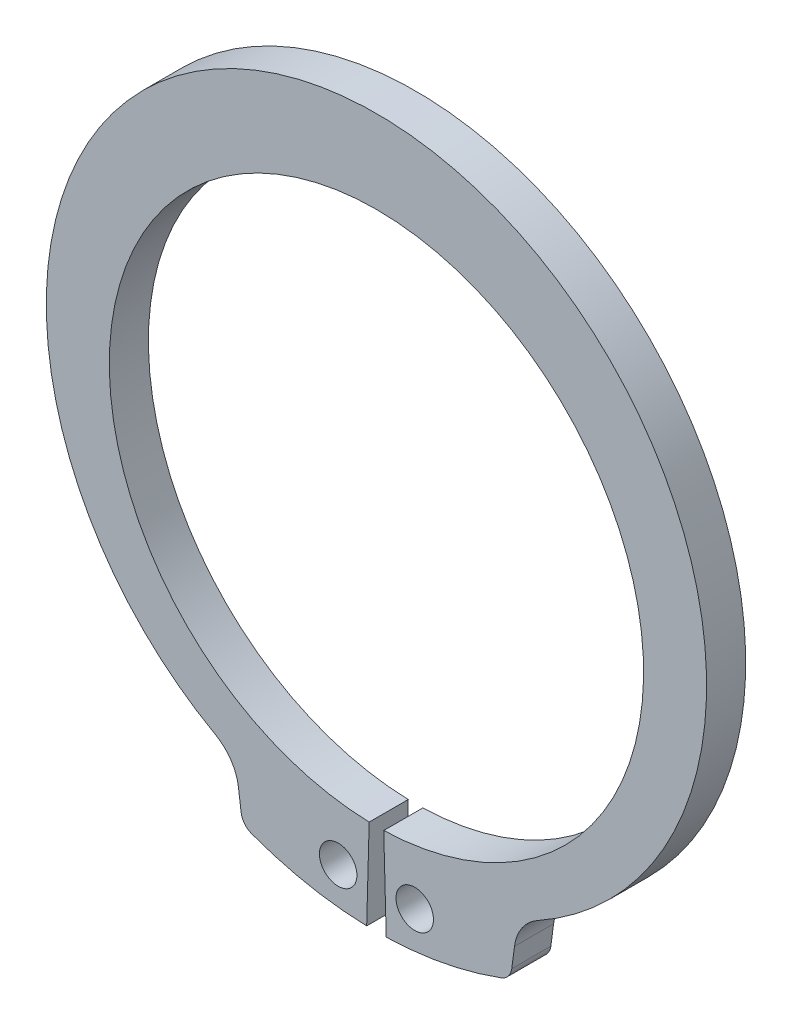
ISO-10303-21;
HEADER;
FILE_DESCRIPTION(('STEP AP214'),'2;1');
FILE_NAME('part.step','',(''),(''),'','','');
FILE_SCHEMA(('AUTOMOTIVE_DESIGN { 1 0 10303 214 1 1 1 1 }'));
ENDSEC;
DATA;
#1=APPLICATION_CONTEXT('core data for automotive mechanical design processes');
#2=APPLICATION_PROTOCOL_DEFINITION('international standard','automotive_design',2000,#1);
#3=PRODUCT_CONTEXT('',#1,'mechanical');
#4=PRODUCT('Part','Part','',(#3));
#5=PRODUCT_RELATED_PRODUCT_CATEGORY('part','',(#4));
#6=PRODUCT_DEFINITION_FORMATION('','',#4);
#7=PRODUCT_DEFINITION_CONTEXT('part definition',#1,'design');
#8=PRODUCT_DEFINITION('design','',#6,#7);
#9=PRODUCT_DEFINITION_SHAPE('','',#8);
#10=(LENGTH_UNIT() NAMED_UNIT(*) SI_UNIT(.MILLI.,.METRE.));
#11=(NAMED_UNIT(*) PLANE_ANGLE_UNIT() SI_UNIT($,.RADIAN.));
#12=(NAMED_UNIT(*) SI_UNIT($,.STERADIAN.) SOLID_ANGLE_UNIT());
#13=UNCERTAINTY_MEASURE_WITH_UNIT(LENGTH_MEASURE(1.E-05),#10,'distance_accuracy_value','');
#14=(GEOMETRIC_REPRESENTATION_CONTEXT(3) GLOBAL_UNCERTAINTY_ASSIGNED_CONTEXT((#13)) GLOBAL_UNIT_ASSIGNED_CONTEXT((#10,
#11,#12)) REPRESENTATION_CONTEXT('',''));
#15=CARTESIAN_POINT('',(0.,0.,0.));
#16=DIRECTION('',(0.,0.,1.));
#17=DIRECTION('',(1.,0.,0.));
#18=AXIS2_PLACEMENT_3D('',#15,#16,#17);
#19=CARTESIAN_POINT('',(0.,0.,-2.4));
#20=DIRECTION('',(0.,0.,1.));
#21=DIRECTION('',(1.,0.,0.));
#22=AXIS2_PLACEMENT_3D('',#19,#20,#21);
#23=CYLINDRICAL_SURFACE('',#22,16.4);
#24=CARTESIAN_POINT('',(0.,0.,0.));
#25=DIRECTION('',(0.,0.,-1.));
#26=DIRECTION('',(1.,0.,0.));
#27=AXIS2_PLACEMENT_3D('',#24,#25,#26);
#28=CIRCLE('',#27,16.4);
#29=CARTESIAN_POINT('',(-0.447272727272727,-16.3938996918805,0.));
#30=VERTEX_POINT('',#29);
#31=CARTESIAN_POINT('',(0.447272727272727,-16.3938996918805,0.));
#32=VERTEX_POINT('',#31);
#33=EDGE_CURVE('E153',#30,#32,#28,.T.);
#34=ORIENTED_EDGE('',*,*,#33,.F.);
#35=DIRECTION('',(0.,0.,1.));
#36=VECTOR('',#35,1.);
#37=CARTESIAN_POINT('',(-0.447272727272727,-16.3938996918805,-2.4));
#38=LINE('',#37,#36);
#39=CARTESIAN_POINT('',(-0.447272727272727,-16.3938996918805,-2.4));
#40=VERTEX_POINT('',#39);
#41=EDGE_CURVE('E11',#40,#30,#38,.T.);
#42=ORIENTED_EDGE('',*,*,#41,.F.);
#43=CARTESIAN_POINT('',(0.,0.,-2.4));
#44=DIRECTION('',(0.,0.,-1.));
#45=DIRECTION('',(1.,0.,0.));
#46=AXIS2_PLACEMENT_3D('',#43,#44,#45);
#47=CIRCLE('',#46,16.4);
#48=CARTESIAN_POINT('',(0.447272727272727,-16.3938996918805,-2.4));
#49=VERTEX_POINT('',#48);
#50=EDGE_CURVE('E186',#40,#49,#47,.T.);
#51=ORIENTED_EDGE('',*,*,#50,.T.);
#52=DIRECTION('',(0.,0.,1.));
#53=VECTOR('',#52,1.);
#54=CARTESIAN_POINT('',(0.447272727272727,-16.3938996918805,-2.4));
#55=LINE('',#54,#53);
#56=EDGE_CURVE('E35',#49,#32,#55,.T.);
#57=ORIENTED_EDGE('',*,*,#56,.T.);
#58=EDGE_LOOP('',(#34,#42,#51,#57));
#59=FACE_BOUND('',#58,.T.);
#60=ADVANCED_FACE('F32',(#59),#23,.F.);
#61=CARTESIAN_POINT('',(-0.447272727272727,-16.3938996918805,-2.4));
#62=DIRECTION('',(0.999628029992711,-0.0272727272727273,0.));
#63=DIRECTION('',(0.0272727272727273,0.999628029992711,0.));
#64=AXIS2_PLACEMENT_3D('',#61,#62,#63);
#65=PLANE('',#64);
#66=DIRECTION('',(0.0272727272727273,0.999628029992711,0.));
#67=VECTOR('',#66,1.);
#68=CARTESIAN_POINT('',(-0.447272727272727,-16.3938996918805,0.));
#69=LINE('',#68,#67);
#70=CARTESIAN_POINT('',(-0.6,-21.9918166598396,0.));
#71=VERTEX_POINT('',#70);
#72=EDGE_CURVE('E184',#71,#30,#69,.T.);
#73=ORIENTED_EDGE('',*,*,#72,.F.);
#74=DIRECTION('',(0.,0.,1.));
#75=VECTOR('',#74,1.);
#76=CARTESIAN_POINT('',(-0.6,-21.9918166598396,-2.4));
#77=LINE('',#76,#75);
#78=CARTESIAN_POINT('',(-0.6,-21.9918166598396,-2.4));
#79=VERTEX_POINT('',#78);
#80=EDGE_CURVE('E41',#79,#71,#77,.T.);
#81=ORIENTED_EDGE('',*,*,#80,.F.);
#82=DIRECTION('',(0.0272727272727273,0.999628029992711,0.));
#83=VECTOR('',#82,1.);
#84=CARTESIAN_POINT('',(-0.447272727272727,-16.3938996918805,-2.4));
#85=LINE('',#84,#83);
#86=EDGE_CURVE('E143',#79,#40,#85,.T.);
#87=ORIENTED_EDGE('',*,*,#86,.T.);
#88=ORIENTED_EDGE('',*,*,#41,.T.);
#89=EDGE_LOOP('',(#73,#81,#87,#88));
#90=FACE_BOUND('',#89,.T.);
#91=ADVANCED_FACE('F206',(#90),#65,.T.);
#92=CARTESIAN_POINT('',(0.,0.,-2.4));
#93=DIRECTION('',(0.,0.,1.));
#94=DIRECTION('',(1.,0.,0.));
#95=AXIS2_PLACEMENT_3D('',#92,#93,#94);
#96=CYLINDRICAL_SURFACE('',#95,22.);
#97=CARTESIAN_POINT('',(0.,0.,0.));
#98=DIRECTION('',(0.,0.,1.));
#99=DIRECTION('',(1.,0.,0.));
#100=AXIS2_PLACEMENT_3D('',#97,#98,#99);
#101=CIRCLE('',#100,22.);
#102=CARTESIAN_POINT('',(-7.66322406061849,-20.6221967063831,0.));
#103=VERTEX_POINT('',#102);
#104=EDGE_CURVE('E130',#103,#71,#101,.T.);
#105=ORIENTED_EDGE('',*,*,#104,.F.);
#106=DIRECTION('',(0.,0.,1.));
#107=VECTOR('',#106,1.);
#108=CARTESIAN_POINT('',(-7.66322406061849,-20.6221967063831,-2.4));
#109=LINE('',#108,#107);
#110=CARTESIAN_POINT('',(-7.66322406061849,-20.6221967063831,-2.4));
#111=VERTEX_POINT('',#110);
#112=EDGE_CURVE('E125',#111,#103,#109,.T.);
#113=ORIENTED_EDGE('',*,*,#112,.F.);
#114=CARTESIAN_POINT('',(0.,0.,-2.4));
#115=DIRECTION('',(0.,0.,1.));
#116=DIRECTION('',(1.,0.,0.));
#117=AXIS2_PLACEMENT_3D('',#114,#115,#116);
#118=CIRCLE('',#117,22.);
#119=EDGE_CURVE('E128',#111,#79,#118,.T.);
#120=ORIENTED_EDGE('',*,*,#119,.T.);
#121=ORIENTED_EDGE('',*,*,#80,.T.);
#122=EDGE_LOOP('',(#105,#113,#120,#121));
#123=FACE_BOUND('',#122,.T.);
#124=ADVANCED_FACE('F127',(#123),#96,.T.);
#125=CARTESIAN_POINT('',(-7.31489569422674,-19.6848241288202,-2.4));
#126=DIRECTION('',(0.,0.,1.));
#127=DIRECTION('',(1.,0.,0.));
#128=AXIS2_PLACEMENT_3D('',#125,#126,#127);
#129=CYLINDRICAL_SURFACE('',#128,1.);
#130=CARTESIAN_POINT('',(-7.31489569422674,-19.6848241288202,0.));
#131=DIRECTION('',(0.,0.,1.));
#132=DIRECTION('',(1.,0.,0.));
#133=AXIS2_PLACEMENT_3D('',#130,#131,#132);
#134=CIRCLE('',#133,1.);
#135=CARTESIAN_POINT('',(-8.30634055560055,-19.8153503210403,0.));
#136=VERTEX_POINT('',#135);
#137=EDGE_CURVE('E181',#136,#103,#134,.T.);
#138=ORIENTED_EDGE('',*,*,#137,.F.);
#139=DIRECTION('',(0.,0.,1.));
#140=VECTOR('',#139,1.);
#141=CARTESIAN_POINT('',(-8.30634055560055,-19.8153503210403,-2.4));
#142=LINE('',#141,#140);
#143=CARTESIAN_POINT('',(-8.30634055560055,-19.8153503210403,-2.4));
#144=VERTEX_POINT('',#143);
#145=EDGE_CURVE('E135',#144,#136,#142,.T.);
#146=ORIENTED_EDGE('',*,*,#145,.F.);
#147=CARTESIAN_POINT('',(-7.31489569422674,-19.6848241288202,-2.4));
#148=DIRECTION('',(0.,0.,1.));
#149=DIRECTION('',(1.,0.,0.));
#150=AXIS2_PLACEMENT_3D('',#147,#148,#149);
#151=CIRCLE('',#150,1.);
#152=EDGE_CURVE('E141',#144,#111,#151,.T.);
#153=ORIENTED_EDGE('',*,*,#152,.T.);
#154=ORIENTED_EDGE('',*,*,#112,.T.);
#155=EDGE_LOOP('',(#138,#146,#153,#154));
#156=FACE_BOUND('',#155,.T.);
#157=ADVANCED_FACE('F145',(#156),#129,.T.);
#158=CARTESIAN_POINT('',(-8.47406820275926,-18.5413323553168,-2.4));
#159=DIRECTION('',(-0.991444861373811,-0.130526192220046,0.));
#160=DIRECTION('',(0.130526192220046,-0.991444861373811,0.));
#161=AXIS2_PLACEMENT_3D('',#158,#159,#160);
#162=PLANE('',#161);
#163=DIRECTION('',(0.130526192220046,-0.991444861373811,0.));
#164=VECTOR('',#163,1.);
#165=CARTESIAN_POINT('',(-8.47406820275926,-18.5413323553168,0.));
#166=LINE('',#165,#164);
#167=CARTESIAN_POINT('',(-8.47406820275926,-18.5413323553168,0.));
#168=VERTEX_POINT('',#167);
#169=EDGE_CURVE('E178',#168,#136,#166,.T.);
#170=ORIENTED_EDGE('',*,*,#169,.F.);
#171=DIRECTION('',(0.,0.,1.));
#172=VECTOR('',#171,1.);
#173=CARTESIAN_POINT('',(-8.47406820275926,-18.5413323553168,-2.4));
#174=LINE('',#173,#172);
#175=CARTESIAN_POINT('',(-8.47406820275926,-18.5413323553168,-2.4));
#176=VERTEX_POINT('',#175);
#177=EDGE_CURVE('E190',#176,#168,#174,.T.);
#178=ORIENTED_EDGE('',*,*,#177,.F.);
#179=DIRECTION('',(0.130526192220046,-0.991444861373811,0.));
#180=VECTOR('',#179,1.);
#181=CARTESIAN_POINT('',(-8.47406820275926,-18.5413323553168,-2.4));
#182=LINE('',#181,#180);
#183=EDGE_CURVE('E146',#176,#144,#182,.T.);
#184=ORIENTED_EDGE('',*,*,#183,.T.);
#185=ORIENTED_EDGE('',*,*,#145,.T.);
#186=EDGE_LOOP('',(#170,#178,#184,#185));
#187=FACE_BOUND('',#186,.T.);
#188=ADVANCED_FACE('F219',(#187),#162,.T.);
#189=CARTESIAN_POINT('',(-11.2489360281673,-18.9066506350067,-2.4));
#190=DIRECTION('',(0.,0.,1.));
#191=DIRECTION('',(1.,0.,0.));
#192=AXIS2_PLACEMENT_3D('',#189,#190,#191);
#193=CYLINDRICAL_SURFACE('',#192,2.79881205048863);
#194=CARTESIAN_POINT('',(-11.2489360281673,-18.9066506350067,0.));
#195=DIRECTION('',(0.,0.,-1.));
#196=DIRECTION('',(1.,0.,0.));
#197=AXIS2_PLACEMENT_3D('',#194,#195,#196);
#198=CIRCLE('',#197,2.79881205048863);
#199=CARTESIAN_POINT('',(-9.8840639739305,-16.4631954646539,0.));
#200=VERTEX_POINT('',#199);
#201=EDGE_CURVE('E175',#200,#168,#198,.T.);
#202=ORIENTED_EDGE('',*,*,#201,.F.);
#203=DIRECTION('',(0.,0.,1.));
#204=VECTOR('',#203,1.);
#205=CARTESIAN_POINT('',(-9.8840639739305,-16.4631954646539,-2.4));
#206=LINE('',#205,#204);
#207=CARTESIAN_POINT('',(-9.8840639739305,-16.4631954646539,-2.4));
#208=VERTEX_POINT('',#207);
#209=EDGE_CURVE('E192',#208,#200,#206,.T.);
#210=ORIENTED_EDGE('',*,*,#209,.F.);
#211=CARTESIAN_POINT('',(-11.2489360281673,-18.9066506350067,-2.4));
#212=DIRECTION('',(0.,0.,-1.));
#213=DIRECTION('',(1.,0.,0.));
#214=AXIS2_PLACEMENT_3D('',#211,#212,#213);
#215=CIRCLE('',#214,2.79881205048863);
#216=EDGE_CURVE('E148',#208,#176,#215,.T.);
#217=ORIENTED_EDGE('',*,*,#216,.T.);
#218=ORIENTED_EDGE('',*,*,#177,.T.);
#219=EDGE_LOOP('',(#202,#210,#217,#218));
#220=FACE_BOUND('',#219,.T.);
#221=ADVANCED_FACE('F222',(#220),#193,.F.);
#222=CARTESIAN_POINT('',(0.,1.23169919322148,-2.4));
#223=DIRECTION('',(0.,0.,1.));
#224=DIRECTION('',(1.,0.,0.));
#225=AXIS2_PLACEMENT_3D('',#222,#223,#224);
#226=CYLINDRICAL_SURFACE('',#225,20.2683008067785);
#227=CARTESIAN_POINT('',(0.,1.23169919322148,0.));
#228=DIRECTION('',(0.,0.,1.));
#229=DIRECTION('',(1.,0.,0.));
#230=AXIS2_PLACEMENT_3D('',#227,#228,#229);
#231=CIRCLE('',#230,20.2683008067785);
#232=CARTESIAN_POINT('',(9.8840639739305,-16.4631954646539,0.));
#233=VERTEX_POINT('',#232);
#234=EDGE_CURVE('E172',#233,#200,#231,.T.);
#235=ORIENTED_EDGE('',*,*,#234,.F.);
#236=DIRECTION('',(0.,0.,1.));
#237=VECTOR('',#236,1.);
#238=CARTESIAN_POINT('',(9.8840639739305,-16.4631954646539,-2.4));
#239=LINE('',#238,#237);
#240=CARTESIAN_POINT('',(9.8840639739305,-16.4631954646539,-2.4));
#241=VERTEX_POINT('',#240);
#242=EDGE_CURVE('E194',#241,#233,#239,.T.);
#243=ORIENTED_EDGE('',*,*,#242,.F.);
#244=CARTESIAN_POINT('',(0.,1.23169919322148,-2.4));
#245=DIRECTION('',(0.,0.,1.));
#246=DIRECTION('',(1.,0.,0.));
#247=AXIS2_PLACEMENT_3D('',#244,#245,#246);
#248=CIRCLE('',#247,20.2683008067785);
#249=EDGE_CURVE('E296',#241,#208,#248,.T.);
#250=ORIENTED_EDGE('',*,*,#249,.T.);
#251=ORIENTED_EDGE('',*,*,#209,.T.);
#252=EDGE_LOOP('',(#235,#243,#250,#251));
#253=FACE_BOUND('',#252,.T.);
#254=ADVANCED_FACE('F226',(#253),#226,.T.);
#255=CARTESIAN_POINT('',(11.2489360281673,-18.9066506350067,-2.4));
#256=DIRECTION('',(0.,0.,1.));
#257=DIRECTION('',(1.,0.,0.));
#258=AXIS2_PLACEMENT_3D('',#255,#256,#257);
#259=CYLINDRICAL_SURFACE('',#258,2.79881205048863);
#260=CARTESIAN_POINT('',(11.2489360281673,-18.9066506350067,0.));
#261=DIRECTION('',(0.,0.,-1.));
#262=DIRECTION('',(1.,0.,0.));
#263=AXIS2_PLACEMENT_3D('',#260,#261,#262);
#264=CIRCLE('',#263,2.79881205048863);
#265=CARTESIAN_POINT('',(8.47406820275926,-18.5413323553168,0.));
#266=VERTEX_POINT('',#265);
#267=EDGE_CURVE('E169',#266,#233,#264,.T.);
#268=ORIENTED_EDGE('',*,*,#267,.F.);
#269=DIRECTION('',(0.,0.,1.));
#270=VECTOR('',#269,1.);
#271=CARTESIAN_POINT('',(8.47406820275926,-18.5413323553168,-2.4));
#272=LINE('',#271,#270);
#273=CARTESIAN_POINT('',(8.47406820275926,-18.5413323553168,-2.4));
#274=VERTEX_POINT('',#273);
#275=EDGE_CURVE('E196',#274,#266,#272,.T.);
#276=ORIENTED_EDGE('',*,*,#275,.F.);
#277=CARTESIAN_POINT('',(11.2489360281673,-18.9066506350067,-2.4));
#278=DIRECTION('',(0.,0.,-1.));
#279=DIRECTION('',(1.,0.,0.));
#280=AXIS2_PLACEMENT_3D('',#277,#278,#279);
#281=CIRCLE('',#280,2.79881205048863);
#282=EDGE_CURVE('E293',#274,#241,#281,.T.);
#283=ORIENTED_EDGE('',*,*,#282,.T.);
#284=ORIENTED_EDGE('',*,*,#242,.T.);
#285=EDGE_LOOP('',(#268,#276,#283,#284));
#286=FACE_BOUND('',#285,.T.);
#287=ADVANCED_FACE('F230',(#286),#259,.F.);
#288=CARTESIAN_POINT('',(8.47406820275926,-18.5413323553168,-2.4));
#289=DIRECTION('',(0.991444861373811,-0.130526192220046,0.));
#290=DIRECTION('',(0.130526192220046,0.991444861373811,0.));
#291=AXIS2_PLACEMENT_3D('',#288,#289,#290);
#292=PLANE('',#291);
#293=DIRECTION('',(0.130526192220046,0.991444861373811,0.));
#294=VECTOR('',#293,1.);
#295=CARTESIAN_POINT('',(8.47406820275926,-18.5413323553168,0.));
#296=LINE('',#295,#294);
#297=CARTESIAN_POINT('',(8.30634055560056,-19.8153503210403,0.));
#298=VERTEX_POINT('',#297);
#299=EDGE_CURVE('E166',#298,#266,#296,.T.);
#300=ORIENTED_EDGE('',*,*,#299,.F.);
#301=DIRECTION('',(0.,0.,1.));
#302=VECTOR('',#301,1.);
#303=CARTESIAN_POINT('',(8.30634055560056,-19.8153503210403,-2.4));
#304=LINE('',#303,#302);
#305=CARTESIAN_POINT('',(8.30634055560056,-19.8153503210403,-2.4));
#306=VERTEX_POINT('',#305);
#307=EDGE_CURVE('E198',#306,#298,#304,.T.);
#308=ORIENTED_EDGE('',*,*,#307,.F.);
#309=DIRECTION('',(0.130526192220046,0.991444861373811,0.));
#310=VECTOR('',#309,1.);
#311=CARTESIAN_POINT('',(8.47406820275926,-18.5413323553168,-2.4));
#312=LINE('',#311,#310);
#313=EDGE_CURVE('E290',#306,#274,#312,.T.);
#314=ORIENTED_EDGE('',*,*,#313,.T.);
#315=ORIENTED_EDGE('',*,*,#275,.T.);
#316=EDGE_LOOP('',(#300,#308,#314,#315));
#317=FACE_BOUND('',#316,.T.);
#318=ADVANCED_FACE('F234',(#317),#292,.T.);
#319=CARTESIAN_POINT('',(7.31489569422674,-19.6848241288202,-2.4));
#320=DIRECTION('',(0.,0.,1.));
#321=DIRECTION('',(1.,0.,0.));
#322=AXIS2_PLACEMENT_3D('',#319,#320,#321);
#323=CYLINDRICAL_SURFACE('',#322,1.);
#324=CARTESIAN_POINT('',(7.31489569422674,-19.6848241288202,0.));
#325=DIRECTION('',(0.,0.,1.));
#326=DIRECTION('',(-1.,0.,0.));
#327=AXIS2_PLACEMENT_3D('',#324,#325,#326);
#328=CIRCLE('',#327,1.);
#329=CARTESIAN_POINT('',(7.66322406061849,-20.6221967063831,0.));
#330=VERTEX_POINT('',#329);
#331=EDGE_CURVE('E163',#330,#298,#328,.T.);
#332=ORIENTED_EDGE('',*,*,#331,.F.);
#333=DIRECTION('',(0.,0.,1.));
#334=VECTOR('',#333,1.);
#335=CARTESIAN_POINT('',(7.66322406061849,-20.6221967063831,-2.4));
#336=LINE('',#335,#334);
#337=CARTESIAN_POINT('',(7.66322406061849,-20.6221967063831,-2.4));
#338=VERTEX_POINT('',#337);
#339=EDGE_CURVE('E200',#338,#330,#336,.T.);
#340=ORIENTED_EDGE('',*,*,#339,.F.);
#341=CARTESIAN_POINT('',(7.31489569422674,-19.6848241288202,-2.4));
#342=DIRECTION('',(0.,0.,1.));
#343=DIRECTION('',(-1.,0.,0.));
#344=AXIS2_PLACEMENT_3D('',#341,#342,#343);
#345=CIRCLE('',#344,1.);
#346=EDGE_CURVE('E287',#338,#306,#345,.T.);
#347=ORIENTED_EDGE('',*,*,#346,.T.);
#348=ORIENTED_EDGE('',*,*,#307,.T.);
#349=EDGE_LOOP('',(#332,#340,#347,#348));
#350=FACE_BOUND('',#349,.T.);
#351=ADVANCED_FACE('F238',(#350),#323,.T.);
#352=CARTESIAN_POINT('',(0.,0.,-2.4));
#353=DIRECTION('',(0.,0.,1.));
#354=DIRECTION('',(1.,0.,0.));
#355=AXIS2_PLACEMENT_3D('',#352,#353,#354);
#356=CYLINDRICAL_SURFACE('',#355,22.);
#357=CARTESIAN_POINT('',(0.,0.,0.));
#358=DIRECTION('',(0.,0.,1.));
#359=DIRECTION('',(1.,0.,0.));
#360=AXIS2_PLACEMENT_3D('',#357,#358,#359);
#361=CIRCLE('',#360,22.);
#362=CARTESIAN_POINT('',(0.599999999999996,-21.9918166598396,0.));
#363=VERTEX_POINT('',#362);
#364=EDGE_CURVE('E160',#363,#330,#361,.T.);
#365=ORIENTED_EDGE('',*,*,#364,.F.);
#366=DIRECTION('',(0.,0.,1.));
#367=VECTOR('',#366,1.);
#368=CARTESIAN_POINT('',(0.599999999999996,-21.9918166598396,-2.4));
#369=LINE('',#368,#367);
#370=CARTESIAN_POINT('',(0.599999999999996,-21.9918166598396,-2.4));
#371=VERTEX_POINT('',#370);
#372=EDGE_CURVE('E201',#371,#363,#369,.T.);
#373=ORIENTED_EDGE('',*,*,#372,.F.);
#374=CARTESIAN_POINT('',(0.,0.,-2.4));
#375=DIRECTION('',(0.,0.,1.));
#376=DIRECTION('',(1.,0.,0.));
#377=AXIS2_PLACEMENT_3D('',#374,#375,#376);
#378=CIRCLE('',#377,22.);
#379=EDGE_CURVE('E284',#371,#338,#378,.T.);
#380=ORIENTED_EDGE('',*,*,#379,.T.);
#381=ORIENTED_EDGE('',*,*,#339,.T.);
#382=EDGE_LOOP('',(#365,#373,#380,#381));
#383=FACE_BOUND('',#382,.T.);
#384=ADVANCED_FACE('F242',(#383),#356,.T.);
#385=CARTESIAN_POINT('',(0.447272727272727,-16.3938996918805,-2.4));
#386=DIRECTION('',(-0.999628029992711,-0.0272727272727273,0.));
#387=DIRECTION('',(0.0272727272727273,-0.999628029992711,0.));
#388=AXIS2_PLACEMENT_3D('',#385,#386,#387);
#389=PLANE('',#388);
#390=DIRECTION('',(0.0272727272727273,-0.999628029992711,0.));
#391=VECTOR('',#390,1.);
#392=CARTESIAN_POINT('',(0.447272727272727,-16.3938996918805,0.));
#393=LINE('',#392,#391);
#394=EDGE_CURVE('E156',#32,#363,#393,.T.);
#395=ORIENTED_EDGE('',*,*,#394,.F.);
#396=ORIENTED_EDGE('',*,*,#56,.F.);
#397=DIRECTION('',(0.0272727272727273,-0.999628029992711,0.));
#398=VECTOR('',#397,1.);
#399=CARTESIAN_POINT('',(0.447272727272727,-16.3938996918805,-2.4));
#400=LINE('',#399,#398);
#401=EDGE_CURVE('E282',#49,#371,#400,.T.);
#402=ORIENTED_EDGE('',*,*,#401,.T.);
#403=ORIENTED_EDGE('',*,*,#372,.T.);
#404=EDGE_LOOP('',(#395,#396,#402,#403));
#405=FACE_BOUND('',#404,.T.);
#406=ADVANCED_FACE('F203',(#405),#389,.T.);
#407=CARTESIAN_POINT('',(0.,0.,-2.4));
#408=DIRECTION('',(0.,0.,1.));
#409=DIRECTION('',(1.,0.,0.));
#410=AXIS2_PLACEMENT_3D('',#407,#408,#409);
#411=PLANE('',#410);
#412=CARTESIAN_POINT('',(-2.35,-19.6096914815099,-2.4));
#413=DIRECTION('',(0.,0.,1.));
#414=DIRECTION('',(1.,0.,0.));
#415=AXIS2_PLACEMENT_3D('',#412,#413,#414);
#416=CIRCLE('',#415,1.15);
#417=CARTESIAN_POINT('',(-1.2,-19.6096914815099,-2.4));
#418=VERTEX_POINT('',#417);
#419=EDGE_CURVE('E269',#418,#418,#416,.T.);
#420=ORIENTED_EDGE('',*,*,#419,.T.);
#421=EDGE_LOOP('',(#420));
#422=FACE_BOUND('',#421,.T.);
#423=CARTESIAN_POINT('',(2.35,-19.6096914815099,-2.4));
#424=DIRECTION('',(0.,0.,1.));
#425=DIRECTION('',(1.,0.,0.));
#426=AXIS2_PLACEMENT_3D('',#423,#424,#425);
#427=CIRCLE('',#426,1.15);
#428=CARTESIAN_POINT('',(3.5,-19.6096914815099,-2.4));
#429=VERTEX_POINT('',#428);
#430=EDGE_CURVE('E157',#429,#429,#427,.T.);
#431=ORIENTED_EDGE('',*,*,#430,.T.);
#432=EDGE_LOOP('',(#431));
#433=FACE_BOUND('',#432,.T.);
#434=ORIENTED_EDGE('',*,*,#50,.F.);
#435=ORIENTED_EDGE('',*,*,#86,.F.);
#436=ORIENTED_EDGE('',*,*,#119,.F.);
#437=ORIENTED_EDGE('',*,*,#152,.F.);
#438=ORIENTED_EDGE('',*,*,#183,.F.);
#439=ORIENTED_EDGE('',*,*,#216,.F.);
#440=ORIENTED_EDGE('',*,*,#249,.F.);
#441=ORIENTED_EDGE('',*,*,#282,.F.);
#442=ORIENTED_EDGE('',*,*,#313,.F.);
#443=ORIENTED_EDGE('',*,*,#346,.F.);
#444=ORIENTED_EDGE('',*,*,#379,.F.);
#445=ORIENTED_EDGE('',*,*,#401,.F.);
#446=EDGE_LOOP('',(#434,#435,#436,#437,#438,#439,#440,#441,#442,#443,#444,#445));
#447=FACE_BOUND('',#446,.T.);
#448=ADVANCED_FACE('F139',(#422,#433,#447),#411,.F.);
#449=CARTESIAN_POINT('',(0.,0.,0.));
#450=DIRECTION('',(0.,0.,1.));
#451=DIRECTION('',(1.,0.,0.));
#452=AXIS2_PLACEMENT_3D('',#449,#450,#451);
#453=PLANE('',#452);
#454=CARTESIAN_POINT('',(-2.35,-19.6096914815099,0.));
#455=DIRECTION('',(0.,0.,1.));
#456=DIRECTION('',(1.,0.,0.));
#457=AXIS2_PLACEMENT_3D('',#454,#455,#456);
#458=CIRCLE('',#457,1.15);
#459=CARTESIAN_POINT('',(-1.2,-19.6096914815099,0.));
#460=VERTEX_POINT('',#459);
#461=EDGE_CURVE('E272',#460,#460,#458,.T.);
#462=ORIENTED_EDGE('',*,*,#461,.F.);
#463=EDGE_LOOP('',(#462));
#464=FACE_BOUND('',#463,.T.);
#465=CARTESIAN_POINT('',(2.35,-19.6096914815099,0.));
#466=DIRECTION('',(0.,0.,1.));
#467=DIRECTION('',(1.,0.,0.));
#468=AXIS2_PLACEMENT_3D('',#465,#466,#467);
#469=CIRCLE('',#468,1.15);
#470=CARTESIAN_POINT('',(3.5,-19.6096914815099,0.));
#471=VERTEX_POINT('',#470);
#472=EDGE_CURVE('E274',#471,#471,#469,.T.);
#473=ORIENTED_EDGE('',*,*,#472,.F.);
#474=EDGE_LOOP('',(#473));
#475=FACE_BOUND('',#474,.T.);
#476=ORIENTED_EDGE('',*,*,#33,.T.);
#477=ORIENTED_EDGE('',*,*,#394,.T.);
#478=ORIENTED_EDGE('',*,*,#364,.T.);
#479=ORIENTED_EDGE('',*,*,#331,.T.);
#480=ORIENTED_EDGE('',*,*,#299,.T.);
#481=ORIENTED_EDGE('',*,*,#267,.T.);
#482=ORIENTED_EDGE('',*,*,#234,.T.);
#483=ORIENTED_EDGE('',*,*,#201,.T.);
#484=ORIENTED_EDGE('',*,*,#169,.T.);
#485=ORIENTED_EDGE('',*,*,#137,.T.);
#486=ORIENTED_EDGE('',*,*,#104,.T.);
#487=ORIENTED_EDGE('',*,*,#72,.T.);
#488=EDGE_LOOP('',(#476,#477,#478,#479,#480,#481,#482,#483,#484,#485,#486,#487));
#489=FACE_BOUND('',#488,.T.);
#490=ADVANCED_FACE('F205',(#464,#475,#489),#453,.T.);
#491=CARTESIAN_POINT('',(2.35,-19.6096914815099,-2.4));
#492=DIRECTION('',(0.,0.,1.));
#493=DIRECTION('',(1.,0.,0.));
#494=AXIS2_PLACEMENT_3D('',#491,#492,#493);
#495=CYLINDRICAL_SURFACE('',#494,1.15);
#496=ORIENTED_EDGE('',*,*,#430,.F.);
#497=EDGE_LOOP('',(#496));
#498=FACE_BOUND('',#497,.T.);
#499=ORIENTED_EDGE('',*,*,#472,.T.);
#500=EDGE_LOOP('',(#499));
#501=FACE_BOUND('',#500,.T.);
#502=ADVANCED_FACE('F254',(#498,#501),#495,.F.);
#503=CARTESIAN_POINT('',(-2.35,-19.6096914815099,-2.4));
#504=DIRECTION('',(0.,0.,1.));
#505=DIRECTION('',(1.,0.,0.));
#506=AXIS2_PLACEMENT_3D('',#503,#504,#505);
#507=CYLINDRICAL_SURFACE('',#506,1.15);
#508=ORIENTED_EDGE('',*,*,#419,.F.);
#509=EDGE_LOOP('',(#508));
#510=FACE_BOUND('',#509,.T.);
#511=ORIENTED_EDGE('',*,*,#461,.T.);
#512=EDGE_LOOP('',(#511));
#513=FACE_BOUND('',#512,.T.);
#514=ADVANCED_FACE('F261',(#510,#513),#507,.F.);
#515=CLOSED_SHELL('',(#60,#91,#124,#157,#188,#221,#254,#287,#318,#351,#384,#406,#448,#490,#502,#514));
#516=MANIFOLD_SOLID_BREP('B2',#515);
#517=ADVANCED_BREP_SHAPE_REPRESENTATION('',(#18,#516),#14);
#518=SHAPE_DEFINITION_REPRESENTATION(#9,#517);
ENDSEC;
END-ISO-10303-21;
